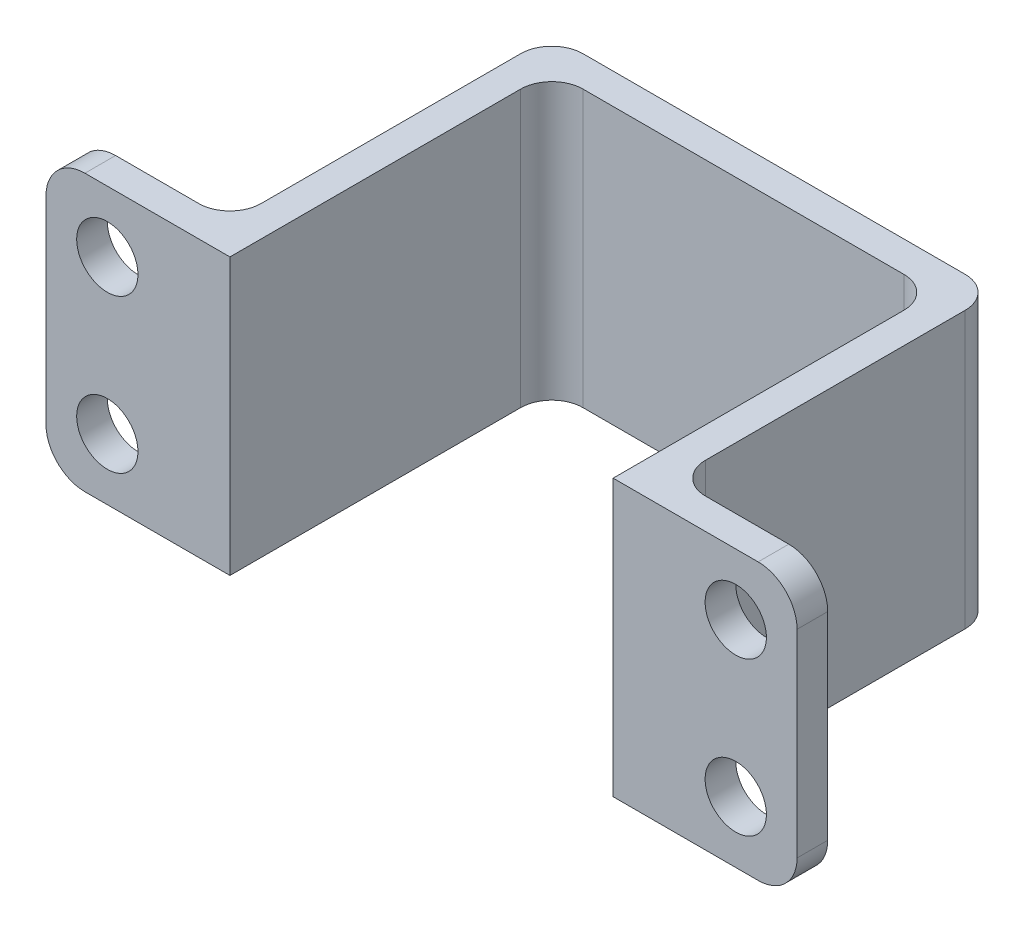
ISO-10303-21;
HEADER;
FILE_DESCRIPTION(('STEP AP214'),'2;1');
FILE_NAME('part.step','',(''),(''),'','','');
FILE_SCHEMA(('AUTOMOTIVE_DESIGN { 1 0 10303 214 1 1 1 1 }'));
ENDSEC;
DATA;
#1=APPLICATION_CONTEXT('core data for automotive mechanical design processes');
#2=APPLICATION_PROTOCOL_DEFINITION('international standard','automotive_design',2000,#1);
#3=PRODUCT_CONTEXT('',#1,'mechanical');
#4=PRODUCT('Part','Part','',(#3));
#5=PRODUCT_RELATED_PRODUCT_CATEGORY('part','',(#4));
#6=PRODUCT_DEFINITION_FORMATION('','',#4);
#7=PRODUCT_DEFINITION_CONTEXT('part definition',#1,'design');
#8=PRODUCT_DEFINITION('design','',#6,#7);
#9=PRODUCT_DEFINITION_SHAPE('','',#8);
#10=(LENGTH_UNIT() NAMED_UNIT(*) SI_UNIT(.MILLI.,.METRE.));
#11=(NAMED_UNIT(*) PLANE_ANGLE_UNIT() SI_UNIT($,.RADIAN.));
#12=(NAMED_UNIT(*) SI_UNIT($,.STERADIAN.) SOLID_ANGLE_UNIT());
#13=UNCERTAINTY_MEASURE_WITH_UNIT(LENGTH_MEASURE(1.E-05),#10,'distance_accuracy_value','');
#14=(GEOMETRIC_REPRESENTATION_CONTEXT(3) GLOBAL_UNCERTAINTY_ASSIGNED_CONTEXT((#13)) GLOBAL_UNIT_ASSIGNED_CONTEXT((#10,
#11,#12)) REPRESENTATION_CONTEXT('',''));
#15=CARTESIAN_POINT('',(0.,0.,0.));
#16=DIRECTION('',(0.,0.,1.));
#17=DIRECTION('',(1.,0.,0.));
#18=AXIS2_PLACEMENT_3D('',#15,#16,#17);
#19=CARTESIAN_POINT('',(0.,9.,0.));
#20=DIRECTION('',(-1.,0.,0.));
#21=DIRECTION('',(0.,0.,1.));
#22=AXIS2_PLACEMENT_3D('',#19,#20,#21);
#23=PLANE('',#22);
#24=DIRECTION('',(0.,0.,-1.));
#25=VECTOR('',#24,1.);
#26=CARTESIAN_POINT('',(0.,0.,0.));
#27=LINE('',#26,#25);
#28=CARTESIAN_POINT('',(0.,0.,0.));
#29=VERTEX_POINT('',#28);
#30=CARTESIAN_POINT('',(0.,0.,-9.48399999999999));
#31=VERTEX_POINT('',#30);
#32=EDGE_CURVE('E333',#29,#31,#27,.T.);
#33=ORIENTED_EDGE('',*,*,#32,.T.);
#34=DIRECTION('',(0.,-1.,0.));
#35=VECTOR('',#34,1.);
#36=CARTESIAN_POINT('',(0.,9.,-9.48399999999999));
#37=LINE('',#36,#35);
#38=CARTESIAN_POINT('',(0.,9.,-9.48399999999999));
#39=VERTEX_POINT('',#38);
#40=EDGE_CURVE('E206',#39,#31,#37,.T.);
#41=ORIENTED_EDGE('',*,*,#40,.F.);
#42=DIRECTION('',(0.,0.,-1.));
#43=VECTOR('',#42,1.);
#44=CARTESIAN_POINT('',(0.,9.,0.));
#45=LINE('',#44,#43);
#46=CARTESIAN_POINT('',(0.,9.,0.));
#47=VERTEX_POINT('',#46);
#48=EDGE_CURVE('E193',#47,#39,#45,.T.);
#49=ORIENTED_EDGE('',*,*,#48,.F.);
#50=DIRECTION('',(0.,-1.,0.));
#51=VECTOR('',#50,1.);
#52=CARTESIAN_POINT('',(0.,9.,0.));
#53=LINE('',#52,#51);
#54=EDGE_CURVE('E204',#47,#29,#53,.T.);
#55=ORIENTED_EDGE('',*,*,#54,.T.);
#56=EDGE_LOOP('',(#33,#41,#49,#55));
#57=FACE_BOUND('',#56,.T.);
#58=ADVANCED_FACE('F39',(#57),#23,.F.);
#59=CARTESIAN_POINT('',(1.016,9.,-9.484));
#60=DIRECTION('',(0.,-1.,0.));
#61=DIRECTION('',(0.,0.,-1.));
#62=AXIS2_PLACEMENT_3D('',#59,#60,#61);
#63=CYLINDRICAL_SURFACE('',#62,1.016);
#64=CARTESIAN_POINT('',(1.016,0.,-9.484));
#65=DIRECTION('',(0.,-1.,0.));
#66=DIRECTION('',(0.,0.,-1.));
#67=AXIS2_PLACEMENT_3D('',#64,#65,#66);
#68=CIRCLE('',#67,1.016);
#69=CARTESIAN_POINT('',(1.016,0.,-10.5));
#70=VERTEX_POINT('',#69);
#71=EDGE_CURVE('E324',#31,#70,#68,.T.);
#72=ORIENTED_EDGE('',*,*,#71,.T.);
#73=DIRECTION('',(0.,-1.,0.));
#74=VECTOR('',#73,1.);
#75=CARTESIAN_POINT('',(1.016,9.,-10.5));
#76=LINE('',#75,#74);
#77=CARTESIAN_POINT('',(1.016,9.,-10.5));
#78=VERTEX_POINT('',#77);
#79=EDGE_CURVE('E222',#78,#70,#76,.T.);
#80=ORIENTED_EDGE('',*,*,#79,.F.);
#81=CARTESIAN_POINT('',(1.016,9.,-9.484));
#82=DIRECTION('',(0.,-1.,0.));
#83=DIRECTION('',(0.,0.,-1.));
#84=AXIS2_PLACEMENT_3D('',#81,#82,#83);
#85=CIRCLE('',#84,1.016);
#86=EDGE_CURVE('E209',#39,#78,#85,.T.);
#87=ORIENTED_EDGE('',*,*,#86,.F.);
#88=ORIENTED_EDGE('',*,*,#40,.T.);
#89=EDGE_LOOP('',(#72,#80,#87,#88));
#90=FACE_BOUND('',#89,.T.);
#91=ADVANCED_FACE('F491',(#90),#63,.F.);
#92=CARTESIAN_POINT('',(1.016,9.,-10.5));
#93=DIRECTION('',(0.,0.,-1.));
#94=DIRECTION('',(-1.,0.,0.));
#95=AXIS2_PLACEMENT_3D('',#92,#93,#94);
#96=PLANE('',#95);
#97=DIRECTION('',(1.,0.,0.));
#98=VECTOR('',#97,1.);
#99=CARTESIAN_POINT('',(1.016,0.,-10.5));
#100=LINE('',#99,#98);
#101=CARTESIAN_POINT('',(11.484,0.,-10.5));
#102=VERTEX_POINT('',#101);
#103=EDGE_CURVE('E317',#70,#102,#100,.T.);
#104=ORIENTED_EDGE('',*,*,#103,.T.);
#105=DIRECTION('',(0.,-1.,0.));
#106=VECTOR('',#105,1.);
#107=CARTESIAN_POINT('',(11.484,9.,-10.5));
#108=LINE('',#107,#106);
#109=CARTESIAN_POINT('',(11.484,9.,-10.5));
#110=VERTEX_POINT('',#109);
#111=EDGE_CURVE('E306',#110,#102,#108,.T.);
#112=ORIENTED_EDGE('',*,*,#111,.F.);
#113=DIRECTION('',(1.,0.,0.));
#114=VECTOR('',#113,1.);
#115=CARTESIAN_POINT('',(1.016,9.,-10.5));
#116=LINE('',#115,#114);
#117=EDGE_CURVE('E318',#78,#110,#116,.T.);
#118=ORIENTED_EDGE('',*,*,#117,.F.);
#119=ORIENTED_EDGE('',*,*,#79,.T.);
#120=EDGE_LOOP('',(#104,#112,#118,#119));
#121=FACE_BOUND('',#120,.T.);
#122=ADVANCED_FACE('F315',(#121),#96,.F.);
#123=CARTESIAN_POINT('',(11.484,9.,-9.484));
#124=DIRECTION('',(0.,-1.,0.));
#125=DIRECTION('',(0.,0.,-1.));
#126=AXIS2_PLACEMENT_3D('',#123,#124,#125);
#127=CYLINDRICAL_SURFACE('',#126,1.016);
#128=CARTESIAN_POINT('',(11.484,0.,-9.484));
#129=DIRECTION('',(0.,-1.,0.));
#130=DIRECTION('',(0.,0.,-1.));
#131=AXIS2_PLACEMENT_3D('',#128,#129,#130);
#132=CIRCLE('',#131,1.016);
#133=CARTESIAN_POINT('',(12.5,0.,-9.48399999999999));
#134=VERTEX_POINT('',#133);
#135=EDGE_CURVE('E326',#102,#134,#132,.T.);
#136=ORIENTED_EDGE('',*,*,#135,.T.);
#137=DIRECTION('',(0.,-1.,0.));
#138=VECTOR('',#137,1.);
#139=CARTESIAN_POINT('',(12.5,9.,-9.48399999999999));
#140=LINE('',#139,#138);
#141=CARTESIAN_POINT('',(12.5,9.,-9.48399999999999));
#142=VERTEX_POINT('',#141);
#143=EDGE_CURVE('E302',#142,#134,#140,.T.);
#144=ORIENTED_EDGE('',*,*,#143,.F.);
#145=CARTESIAN_POINT('',(11.484,9.,-9.484));
#146=DIRECTION('',(0.,-1.,0.));
#147=DIRECTION('',(0.,0.,-1.));
#148=AXIS2_PLACEMENT_3D('',#145,#146,#147);
#149=CIRCLE('',#148,1.016);
#150=EDGE_CURVE('E467',#110,#142,#149,.T.);
#151=ORIENTED_EDGE('',*,*,#150,.F.);
#152=ORIENTED_EDGE('',*,*,#111,.T.);
#153=EDGE_LOOP('',(#136,#144,#151,#152));
#154=FACE_BOUND('',#153,.T.);
#155=ADVANCED_FACE('F561',(#154),#127,.F.);
#156=CARTESIAN_POINT('',(12.5,9.,0.));
#157=DIRECTION('',(1.,0.,0.));
#158=DIRECTION('',(0.,0.,-1.));
#159=AXIS2_PLACEMENT_3D('',#156,#157,#158);
#160=PLANE('',#159);
#161=DIRECTION('',(0.,0.,1.));
#162=VECTOR('',#161,1.);
#163=CARTESIAN_POINT('',(12.5,0.,0.));
#164=LINE('',#163,#162);
#165=CARTESIAN_POINT('',(12.5,0.,0.));
#166=VERTEX_POINT('',#165);
#167=EDGE_CURVE('E331',#134,#166,#164,.T.);
#168=ORIENTED_EDGE('',*,*,#167,.T.);
#169=DIRECTION('',(0.,-1.,0.));
#170=VECTOR('',#169,1.);
#171=CARTESIAN_POINT('',(12.5,9.,0.));
#172=LINE('',#171,#170);
#173=CARTESIAN_POINT('',(12.5,9.,0.));
#174=VERTEX_POINT('',#173);
#175=EDGE_CURVE('E293',#174,#166,#172,.T.);
#176=ORIENTED_EDGE('',*,*,#175,.F.);
#177=DIRECTION('',(0.,0.,1.));
#178=VECTOR('',#177,1.);
#179=CARTESIAN_POINT('',(12.5,9.,0.));
#180=LINE('',#179,#178);
#181=EDGE_CURVE('E276',#142,#174,#180,.T.);
#182=ORIENTED_EDGE('',*,*,#181,.F.);
#183=ORIENTED_EDGE('',*,*,#143,.T.);
#184=EDGE_LOOP('',(#168,#176,#182,#183));
#185=FACE_BOUND('',#184,.T.);
#186=ADVANCED_FACE('F557',(#185),#160,.F.);
#187=CARTESIAN_POINT('',(13.5,9.,0.));
#188=DIRECTION('',(0.,0.,-1.));
#189=DIRECTION('',(-1.,0.,0.));
#190=AXIS2_PLACEMENT_3D('',#187,#188,#189);
#191=PLANE('',#190);
#192=CARTESIAN_POINT('',(16.5,2.,0.));
#193=DIRECTION('',(0.,0.,-1.));
#194=DIRECTION('',(-1.,0.,0.));
#195=AXIS2_PLACEMENT_3D('',#192,#193,#194);
#196=CIRCLE('',#195,1.);
#197=CARTESIAN_POINT('',(15.5,2.,0.));
#198=VERTEX_POINT('',#197);
#199=EDGE_CURVE('E733',#198,#198,#196,.T.);
#200=ORIENTED_EDGE('',*,*,#199,.T.);
#201=EDGE_LOOP('',(#200));
#202=FACE_BOUND('',#201,.T.);
#203=CARTESIAN_POINT('',(16.5,7.,0.));
#204=DIRECTION('',(0.,0.,-1.));
#205=DIRECTION('',(-1.,0.,0.));
#206=AXIS2_PLACEMENT_3D('',#203,#204,#205);
#207=CIRCLE('',#206,1.);
#208=CARTESIAN_POINT('',(15.5,7.,0.));
#209=VERTEX_POINT('',#208);
#210=EDGE_CURVE('E745',#209,#209,#207,.T.);
#211=ORIENTED_EDGE('',*,*,#210,.T.);
#212=EDGE_LOOP('',(#211));
#213=FACE_BOUND('',#212,.T.);
#214=DIRECTION('',(1.,0.,0.));
#215=VECTOR('',#214,1.);
#216=CARTESIAN_POINT('',(13.5,0.,0.));
#217=LINE('',#216,#215);
#218=CARTESIAN_POINT('',(17.23,0.,0.));
#219=VERTEX_POINT('',#218);
#220=EDGE_CURVE('E340',#166,#219,#217,.T.);
#221=ORIENTED_EDGE('',*,*,#220,.T.);
#222=CARTESIAN_POINT('',(17.23,1.27,0.));
#223=DIRECTION('',(0.,0.,-1.));
#224=DIRECTION('',(-1.,0.,0.));
#225=AXIS2_PLACEMENT_3D('',#222,#223,#224);
#226=CIRCLE('',#225,1.27);
#227=CARTESIAN_POINT('',(18.5,1.27,0.));
#228=VERTEX_POINT('',#227);
#229=EDGE_CURVE('E11',#219,#228,#226,.F.);
#230=ORIENTED_EDGE('',*,*,#229,.T.);
#231=DIRECTION('',(0.,-1.,0.));
#232=VECTOR('',#231,1.);
#233=CARTESIAN_POINT('',(18.5,9.,0.));
#234=LINE('',#233,#232);
#235=CARTESIAN_POINT('',(18.5,7.73,0.));
#236=VERTEX_POINT('',#235);
#237=EDGE_CURVE('E271',#236,#228,#234,.T.);
#238=ORIENTED_EDGE('',*,*,#237,.F.);
#239=CARTESIAN_POINT('',(17.23,7.73,0.));
#240=DIRECTION('',(0.,0.,-1.));
#241=DIRECTION('',(-1.,0.,0.));
#242=AXIS2_PLACEMENT_3D('',#239,#240,#241);
#243=CIRCLE('',#242,1.27);
#244=CARTESIAN_POINT('',(17.23,9.,0.));
#245=VERTEX_POINT('',#244);
#246=EDGE_CURVE('E48',#236,#245,#243,.F.);
#247=ORIENTED_EDGE('',*,*,#246,.T.);
#248=DIRECTION('',(1.,0.,0.));
#249=VECTOR('',#248,1.);
#250=CARTESIAN_POINT('',(12.5,9.,0.));
#251=LINE('',#250,#249);
#252=EDGE_CURVE('E270',#174,#245,#251,.T.);
#253=ORIENTED_EDGE('',*,*,#252,.F.);
#254=ORIENTED_EDGE('',*,*,#175,.T.);
#255=EDGE_LOOP('',(#221,#230,#238,#247,#253,#254));
#256=FACE_BOUND('',#255,.T.);
#257=ADVANCED_FACE('F268',(#202,#213,#256),#191,.F.);
#258=CARTESIAN_POINT('',(18.5,9.,0.));
#259=DIRECTION('',(-1.,0.,0.));
#260=DIRECTION('',(0.,0.,1.));
#261=AXIS2_PLACEMENT_3D('',#258,#259,#260);
#262=PLANE('',#261);
#263=ORIENTED_EDGE('',*,*,#237,.T.);
#264=DIRECTION('',(0.,0.,-1.));
#265=VECTOR('',#264,1.);
#266=CARTESIAN_POINT('',(18.5,1.27,-1.));
#267=LINE('',#266,#265);
#268=CARTESIAN_POINT('',(18.5,1.27,-1.));
#269=VERTEX_POINT('',#268);
#270=EDGE_CURVE('E255',#228,#269,#267,.T.);
#271=ORIENTED_EDGE('',*,*,#270,.T.);
#272=DIRECTION('',(0.,-1.,0.));
#273=VECTOR('',#272,1.);
#274=CARTESIAN_POINT('',(18.5,9.,-1.));
#275=LINE('',#274,#273);
#276=CARTESIAN_POINT('',(18.5,7.73,-1.));
#277=VERTEX_POINT('',#276);
#278=EDGE_CURVE('E284',#277,#269,#275,.T.);
#279=ORIENTED_EDGE('',*,*,#278,.F.);
#280=DIRECTION('',(0.,0.,-1.));
#281=VECTOR('',#280,1.);
#282=CARTESIAN_POINT('',(18.5,7.73,0.));
#283=LINE('',#282,#281);
#284=EDGE_CURVE('E60',#277,#236,#283,.F.);
#285=ORIENTED_EDGE('',*,*,#284,.T.);
#286=EDGE_LOOP('',(#263,#271,#279,#285));
#287=FACE_BOUND('',#286,.T.);
#288=ADVANCED_FACE('F286',(#287),#262,.F.);
#289=CARTESIAN_POINT('',(14.516,9.,-1.));
#290=DIRECTION('',(0.,0.,1.));
#291=DIRECTION('',(1.,0.,0.));
#292=AXIS2_PLACEMENT_3D('',#289,#290,#291);
#293=PLANE('',#292);
#294=CARTESIAN_POINT('',(16.5,2.,-1.));
#295=DIRECTION('',(0.,0.,-1.));
#296=DIRECTION('',(-1.,0.,0.));
#297=AXIS2_PLACEMENT_3D('',#294,#295,#296);
#298=CIRCLE('',#297,1.);
#299=CARTESIAN_POINT('',(15.5,2.,-1.));
#300=VERTEX_POINT('',#299);
#301=EDGE_CURVE('E460',#300,#300,#298,.T.);
#302=ORIENTED_EDGE('',*,*,#301,.F.);
#303=EDGE_LOOP('',(#302));
#304=FACE_BOUND('',#303,.T.);
#305=CARTESIAN_POINT('',(16.5,7.,-1.));
#306=DIRECTION('',(0.,0.,-1.));
#307=DIRECTION('',(-1.,0.,0.));
#308=AXIS2_PLACEMENT_3D('',#305,#306,#307);
#309=CIRCLE('',#308,1.);
#310=CARTESIAN_POINT('',(15.5,7.,-1.));
#311=VERTEX_POINT('',#310);
#312=EDGE_CURVE('E741',#311,#311,#309,.T.);
#313=ORIENTED_EDGE('',*,*,#312,.F.);
#314=EDGE_LOOP('',(#313));
#315=FACE_BOUND('',#314,.T.);
#316=ORIENTED_EDGE('',*,*,#278,.T.);
#317=CARTESIAN_POINT('',(17.23,1.27,-1.));
#318=DIRECTION('',(0.,0.,1.));
#319=DIRECTION('',(1.,0.,0.));
#320=AXIS2_PLACEMENT_3D('',#317,#318,#319);
#321=CIRCLE('',#320,1.27);
#322=CARTESIAN_POINT('',(17.23,0.,-1.));
#323=VERTEX_POINT('',#322);
#324=EDGE_CURVE('E262',#269,#323,#321,.F.);
#325=ORIENTED_EDGE('',*,*,#324,.T.);
#326=DIRECTION('',(-1.,0.,0.));
#327=VECTOR('',#326,1.);
#328=CARTESIAN_POINT('',(14.516,0.,-1.));
#329=LINE('',#328,#327);
#330=CARTESIAN_POINT('',(14.516,0.,-1.));
#331=VERTEX_POINT('',#330);
#332=EDGE_CURVE('E343',#323,#331,#329,.T.);
#333=ORIENTED_EDGE('',*,*,#332,.T.);
#334=DIRECTION('',(0.,-1.,0.));
#335=VECTOR('',#334,1.);
#336=CARTESIAN_POINT('',(14.516,9.,-1.));
#337=LINE('',#336,#335);
#338=CARTESIAN_POINT('',(14.516,9.,-1.));
#339=VERTEX_POINT('',#338);
#340=EDGE_CURVE('E289',#339,#331,#337,.T.);
#341=ORIENTED_EDGE('',*,*,#340,.F.);
#342=DIRECTION('',(-1.,0.,0.));
#343=VECTOR('',#342,1.);
#344=CARTESIAN_POINT('',(14.516,9.,-1.));
#345=LINE('',#344,#343);
#346=CARTESIAN_POINT('',(17.23,9.,-1.));
#347=VERTEX_POINT('',#346);
#348=EDGE_CURVE('E279',#347,#339,#345,.T.);
#349=ORIENTED_EDGE('',*,*,#348,.F.);
#350=CARTESIAN_POINT('',(17.23,7.73,-0.999999999999999));
#351=DIRECTION('',(0.,0.,1.));
#352=DIRECTION('',(1.,0.,0.));
#353=AXIS2_PLACEMENT_3D('',#350,#351,#352);
#354=CIRCLE('',#353,1.27);
#355=EDGE_CURVE('E259',#347,#277,#354,.F.);
#356=ORIENTED_EDGE('',*,*,#355,.T.);
#357=EDGE_LOOP('',(#316,#325,#333,#341,#349,#356));
#358=FACE_BOUND('',#357,.T.);
#359=ADVANCED_FACE('F283',(#304,#315,#358),#293,.F.);
#360=CARTESIAN_POINT('',(14.516,9.,-2.016));
#361=DIRECTION('',(0.,-1.,0.));
#362=DIRECTION('',(0.,0.,-1.));
#363=AXIS2_PLACEMENT_3D('',#360,#361,#362);
#364=CYLINDRICAL_SURFACE('',#363,1.016);
#365=CARTESIAN_POINT('',(14.516,0.,-2.016));
#366=DIRECTION('',(0.,-1.,0.));
#367=DIRECTION('',(0.,0.,1.));
#368=AXIS2_PLACEMENT_3D('',#365,#366,#367);
#369=CIRCLE('',#368,1.016);
#370=CARTESIAN_POINT('',(13.5,0.,-2.01600000000001));
#371=VERTEX_POINT('',#370);
#372=EDGE_CURVE('E346',#331,#371,#369,.T.);
#373=ORIENTED_EDGE('',*,*,#372,.T.);
#374=DIRECTION('',(0.,-1.,0.));
#375=VECTOR('',#374,1.);
#376=CARTESIAN_POINT('',(13.5,9.,-2.01600000000001));
#377=LINE('',#376,#375);
#378=CARTESIAN_POINT('',(13.5,9.,-2.01600000000001));
#379=VERTEX_POINT('',#378);
#380=EDGE_CURVE('E296',#379,#371,#377,.T.);
#381=ORIENTED_EDGE('',*,*,#380,.F.);
#382=CARTESIAN_POINT('',(14.516,9.,-2.016));
#383=DIRECTION('',(0.,-1.,0.));
#384=DIRECTION('',(0.,0.,1.));
#385=AXIS2_PLACEMENT_3D('',#382,#383,#384);
#386=CIRCLE('',#385,1.016);
#387=EDGE_CURVE('E474',#339,#379,#386,.T.);
#388=ORIENTED_EDGE('',*,*,#387,.F.);
#389=ORIENTED_EDGE('',*,*,#340,.T.);
#390=EDGE_LOOP('',(#373,#381,#388,#389));
#391=FACE_BOUND('',#390,.T.);
#392=ADVANCED_FACE('F477',(#391),#364,.F.);
#393=CARTESIAN_POINT('',(13.5,9.,-2.01600000000001));
#394=DIRECTION('',(-1.,0.,0.));
#395=DIRECTION('',(0.,0.,1.));
#396=AXIS2_PLACEMENT_3D('',#393,#394,#395);
#397=PLANE('',#396);
#398=DIRECTION('',(0.,0.,-1.));
#399=VECTOR('',#398,1.);
#400=CARTESIAN_POINT('',(13.5,0.,-2.01600000000001));
#401=LINE('',#400,#399);
#402=CARTESIAN_POINT('',(13.5,0.,-10.484));
#403=VERTEX_POINT('',#402);
#404=EDGE_CURVE('E349',#371,#403,#401,.T.);
#405=ORIENTED_EDGE('',*,*,#404,.T.);
#406=DIRECTION('',(0.,-1.,0.));
#407=VECTOR('',#406,1.);
#408=CARTESIAN_POINT('',(13.5,9.,-10.484));
#409=LINE('',#408,#407);
#410=CARTESIAN_POINT('',(13.5,9.,-10.484));
#411=VERTEX_POINT('',#410);
#412=EDGE_CURVE('E401',#411,#403,#409,.T.);
#413=ORIENTED_EDGE('',*,*,#412,.F.);
#414=DIRECTION('',(0.,0.,-1.));
#415=VECTOR('',#414,1.);
#416=CARTESIAN_POINT('',(13.5,9.,-2.01600000000001));
#417=LINE('',#416,#415);
#418=EDGE_CURVE('E412',#379,#411,#417,.T.);
#419=ORIENTED_EDGE('',*,*,#418,.F.);
#420=ORIENTED_EDGE('',*,*,#380,.T.);
#421=EDGE_LOOP('',(#405,#413,#419,#420));
#422=FACE_BOUND('',#421,.T.);
#423=ADVANCED_FACE('F410',(#422),#397,.F.);
#424=CARTESIAN_POINT('',(12.484,9.,-10.484));
#425=DIRECTION('',(0.,-1.,0.));
#426=DIRECTION('',(0.,0.,-1.));
#427=AXIS2_PLACEMENT_3D('',#424,#425,#426);
#428=CYLINDRICAL_SURFACE('',#427,1.016);
#429=CARTESIAN_POINT('',(12.484,0.,-10.484));
#430=DIRECTION('',(0.,1.,0.));
#431=DIRECTION('',(0.,0.,-1.));
#432=AXIS2_PLACEMENT_3D('',#429,#430,#431);
#433=CIRCLE('',#432,1.016);
#434=CARTESIAN_POINT('',(12.484,0.,-11.5));
#435=VERTEX_POINT('',#434);
#436=EDGE_CURVE('E352',#403,#435,#433,.T.);
#437=ORIENTED_EDGE('',*,*,#436,.T.);
#438=DIRECTION('',(0.,-1.,0.));
#439=VECTOR('',#438,1.);
#440=CARTESIAN_POINT('',(12.484,9.,-11.5));
#441=LINE('',#440,#439);
#442=CARTESIAN_POINT('',(12.484,9.,-11.5));
#443=VERTEX_POINT('',#442);
#444=EDGE_CURVE('E397',#443,#435,#441,.T.);
#445=ORIENTED_EDGE('',*,*,#444,.F.);
#446=CARTESIAN_POINT('',(12.484,9.,-10.484));
#447=DIRECTION('',(0.,1.,0.));
#448=DIRECTION('',(0.,0.,-1.));
#449=AXIS2_PLACEMENT_3D('',#446,#447,#448);
#450=CIRCLE('',#449,1.016);
#451=EDGE_CURVE('E432',#411,#443,#450,.T.);
#452=ORIENTED_EDGE('',*,*,#451,.F.);
#453=ORIENTED_EDGE('',*,*,#412,.T.);
#454=EDGE_LOOP('',(#437,#445,#452,#453));
#455=FACE_BOUND('',#454,.T.);
#456=ADVANCED_FACE('F422',(#455),#428,.T.);
#457=CARTESIAN_POINT('',(0.0160000000000071,9.,-11.5));
#458=DIRECTION('',(0.,0.,1.));
#459=DIRECTION('',(1.,0.,0.));
#460=AXIS2_PLACEMENT_3D('',#457,#458,#459);
#461=PLANE('',#460);
#462=DIRECTION('',(-1.,0.,0.));
#463=VECTOR('',#462,1.);
#464=CARTESIAN_POINT('',(0.0160000000000071,0.,-11.5));
#465=LINE('',#464,#463);
#466=CARTESIAN_POINT('',(0.0160000000000071,0.,-11.5));
#467=VERTEX_POINT('',#466);
#468=EDGE_CURVE('E355',#435,#467,#465,.T.);
#469=ORIENTED_EDGE('',*,*,#468,.T.);
#470=DIRECTION('',(0.,-1.,0.));
#471=VECTOR('',#470,1.);
#472=CARTESIAN_POINT('',(0.0160000000000071,9.,-11.5));
#473=LINE('',#472,#471);
#474=CARTESIAN_POINT('',(0.0160000000000071,9.,-11.5));
#475=VERTEX_POINT('',#474);
#476=EDGE_CURVE('E393',#475,#467,#473,.T.);
#477=ORIENTED_EDGE('',*,*,#476,.F.);
#478=DIRECTION('',(-1.,0.,0.));
#479=VECTOR('',#478,1.);
#480=CARTESIAN_POINT('',(0.0160000000000071,9.,-11.5));
#481=LINE('',#480,#479);
#482=EDGE_CURVE('E428',#443,#475,#481,.T.);
#483=ORIENTED_EDGE('',*,*,#482,.F.);
#484=ORIENTED_EDGE('',*,*,#444,.T.);
#485=EDGE_LOOP('',(#469,#477,#483,#484));
#486=FACE_BOUND('',#485,.T.);
#487=ADVANCED_FACE('F426',(#486),#461,.F.);
#488=CARTESIAN_POINT('',(0.0159999999999997,9.,-10.484));
#489=DIRECTION('',(0.,-1.,0.));
#490=DIRECTION('',(0.,0.,-1.));
#491=AXIS2_PLACEMENT_3D('',#488,#489,#490);
#492=CYLINDRICAL_SURFACE('',#491,1.016);
#493=CARTESIAN_POINT('',(0.0159999999999997,0.,-10.484));
#494=DIRECTION('',(0.,1.,0.));
#495=DIRECTION('',(0.,0.,-1.));
#496=AXIS2_PLACEMENT_3D('',#493,#494,#495);
#497=CIRCLE('',#496,1.016);
#498=CARTESIAN_POINT('',(-1.,0.,-10.484));
#499=VERTEX_POINT('',#498);
#500=EDGE_CURVE('E358',#467,#499,#497,.T.);
#501=ORIENTED_EDGE('',*,*,#500,.T.);
#502=DIRECTION('',(0.,-1.,0.));
#503=VECTOR('',#502,1.);
#504=CARTESIAN_POINT('',(-1.,9.,-10.484));
#505=LINE('',#504,#503);
#506=CARTESIAN_POINT('',(-1.,9.,-10.484));
#507=VERTEX_POINT('',#506);
#508=EDGE_CURVE('E389',#507,#499,#505,.T.);
#509=ORIENTED_EDGE('',*,*,#508,.F.);
#510=CARTESIAN_POINT('',(0.0159999999999997,9.,-10.484));
#511=DIRECTION('',(0.,1.,0.));
#512=DIRECTION('',(0.,0.,-1.));
#513=AXIS2_PLACEMENT_3D('',#510,#511,#512);
#514=CIRCLE('',#513,1.016);
#515=EDGE_CURVE('E431',#475,#507,#514,.T.);
#516=ORIENTED_EDGE('',*,*,#515,.F.);
#517=ORIENTED_EDGE('',*,*,#476,.T.);
#518=EDGE_LOOP('',(#501,#509,#516,#517));
#519=FACE_BOUND('',#518,.T.);
#520=ADVANCED_FACE('F533',(#519),#492,.T.);
#521=CARTESIAN_POINT('',(-1.,9.,-2.01600000000001));
#522=DIRECTION('',(1.,0.,0.));
#523=DIRECTION('',(0.,0.,-1.));
#524=AXIS2_PLACEMENT_3D('',#521,#522,#523);
#525=PLANE('',#524);
#526=DIRECTION('',(0.,0.,1.));
#527=VECTOR('',#526,1.);
#528=CARTESIAN_POINT('',(-1.,0.,-2.01600000000001));
#529=LINE('',#528,#527);
#530=CARTESIAN_POINT('',(-1.,0.,-2.01600000000001));
#531=VERTEX_POINT('',#530);
#532=EDGE_CURVE('E361',#499,#531,#529,.T.);
#533=ORIENTED_EDGE('',*,*,#532,.T.);
#534=DIRECTION('',(0.,-1.,0.));
#535=VECTOR('',#534,1.);
#536=CARTESIAN_POINT('',(-1.,9.,-2.01600000000001));
#537=LINE('',#536,#535);
#538=CARTESIAN_POINT('',(-1.,9.,-2.01600000000001));
#539=VERTEX_POINT('',#538);
#540=EDGE_CURVE('E385',#539,#531,#537,.T.);
#541=ORIENTED_EDGE('',*,*,#540,.F.);
#542=DIRECTION('',(0.,0.,1.));
#543=VECTOR('',#542,1.);
#544=CARTESIAN_POINT('',(-1.,9.,-2.01600000000001));
#545=LINE('',#544,#543);
#546=EDGE_CURVE('E436',#507,#539,#545,.T.);
#547=ORIENTED_EDGE('',*,*,#546,.F.);
#548=ORIENTED_EDGE('',*,*,#508,.T.);
#549=EDGE_LOOP('',(#533,#541,#547,#548));
#550=FACE_BOUND('',#549,.T.);
#551=ADVANCED_FACE('F530',(#550),#525,.F.);
#552=CARTESIAN_POINT('',(-2.016,9.,-2.016));
#553=DIRECTION('',(0.,-1.,0.));
#554=DIRECTION('',(0.,0.,-1.));
#555=AXIS2_PLACEMENT_3D('',#552,#553,#554);
#556=CYLINDRICAL_SURFACE('',#555,1.016);
#557=CARTESIAN_POINT('',(-2.016,0.,-2.016));
#558=DIRECTION('',(0.,-1.,0.));
#559=DIRECTION('',(0.,0.,-1.));
#560=AXIS2_PLACEMENT_3D('',#557,#558,#559);
#561=CIRCLE('',#560,1.016);
#562=CARTESIAN_POINT('',(-2.01600000000001,0.,-1.));
#563=VERTEX_POINT('',#562);
#564=EDGE_CURVE('E364',#531,#563,#561,.T.);
#565=ORIENTED_EDGE('',*,*,#564,.T.);
#566=DIRECTION('',(0.,-1.,0.));
#567=VECTOR('',#566,1.);
#568=CARTESIAN_POINT('',(-2.01600000000001,9.,-1.));
#569=LINE('',#568,#567);
#570=CARTESIAN_POINT('',(-2.01600000000001,9.,-1.));
#571=VERTEX_POINT('',#570);
#572=EDGE_CURVE('E381',#571,#563,#569,.T.);
#573=ORIENTED_EDGE('',*,*,#572,.F.);
#574=CARTESIAN_POINT('',(-2.016,9.,-2.016));
#575=DIRECTION('',(0.,-1.,0.));
#576=DIRECTION('',(0.,0.,-1.));
#577=AXIS2_PLACEMENT_3D('',#574,#575,#576);
#578=CIRCLE('',#577,1.016);
#579=EDGE_CURVE('E443',#539,#571,#578,.T.);
#580=ORIENTED_EDGE('',*,*,#579,.F.);
#581=ORIENTED_EDGE('',*,*,#540,.T.);
#582=EDGE_LOOP('',(#565,#573,#580,#581));
#583=FACE_BOUND('',#582,.T.);
#584=ADVANCED_FACE('F526',(#583),#556,.F.);
#585=CARTESIAN_POINT('',(-2.01600000000001,9.,-1.));
#586=DIRECTION('',(0.,0.,1.));
#587=DIRECTION('',(1.,0.,0.));
#588=AXIS2_PLACEMENT_3D('',#585,#586,#587);
#589=PLANE('',#588);
#590=CARTESIAN_POINT('',(-4.,7.,-1.));
#591=DIRECTION('',(0.,0.,-1.));
#592=DIRECTION('',(-1.,0.,0.));
#593=AXIS2_PLACEMENT_3D('',#590,#591,#592);
#594=CIRCLE('',#593,1.);
#595=CARTESIAN_POINT('',(-5.,7.,-0.999999999999999));
#596=VERTEX_POINT('',#595);
#597=EDGE_CURVE('E728',#596,#596,#594,.T.);
#598=ORIENTED_EDGE('',*,*,#597,.F.);
#599=EDGE_LOOP('',(#598));
#600=FACE_BOUND('',#599,.T.);
#601=CARTESIAN_POINT('',(-4.,2.,-1.));
#602=DIRECTION('',(0.,0.,-1.));
#603=DIRECTION('',(-1.,0.,0.));
#604=AXIS2_PLACEMENT_3D('',#601,#602,#603);
#605=CIRCLE('',#604,1.);
#606=CARTESIAN_POINT('',(-5.,2.,-0.999999999999999));
#607=VERTEX_POINT('',#606);
#608=EDGE_CURVE('E451',#607,#607,#605,.T.);
#609=ORIENTED_EDGE('',*,*,#608,.F.);
#610=EDGE_LOOP('',(#609));
#611=FACE_BOUND('',#610,.T.);
#612=DIRECTION('',(-1.,0.,0.));
#613=VECTOR('',#612,1.);
#614=CARTESIAN_POINT('',(-2.01600000000001,0.,-1.));
#615=LINE('',#614,#613);
#616=CARTESIAN_POINT('',(-4.73,0.,-1.));
#617=VERTEX_POINT('',#616);
#618=EDGE_CURVE('E367',#563,#617,#615,.T.);
#619=ORIENTED_EDGE('',*,*,#618,.T.);
#620=CARTESIAN_POINT('',(-4.73,1.27,-1.));
#621=DIRECTION('',(0.,0.,1.));
#622=DIRECTION('',(1.,0.,0.));
#623=AXIS2_PLACEMENT_3D('',#620,#621,#622);
#624=CIRCLE('',#623,1.27);
#625=CARTESIAN_POINT('',(-6.,1.27,-0.999999999999999));
#626=VERTEX_POINT('',#625);
#627=EDGE_CURVE('E244',#617,#626,#624,.F.);
#628=ORIENTED_EDGE('',*,*,#627,.T.);
#629=DIRECTION('',(0.,-1.,0.));
#630=VECTOR('',#629,1.);
#631=CARTESIAN_POINT('',(-6.,9.,-0.999999999999999));
#632=LINE('',#631,#630);
#633=CARTESIAN_POINT('',(-6.,7.73,-0.999999999999999));
#634=VERTEX_POINT('',#633);
#635=EDGE_CURVE('E376',#634,#626,#632,.T.);
#636=ORIENTED_EDGE('',*,*,#635,.F.);
#637=CARTESIAN_POINT('',(-4.73,7.73,-0.999999999999999));
#638=DIRECTION('',(0.,0.,1.));
#639=DIRECTION('',(1.,0.,0.));
#640=AXIS2_PLACEMENT_3D('',#637,#638,#639);
#641=CIRCLE('',#640,1.27);
#642=CARTESIAN_POINT('',(-4.73,9.,-1.));
#643=VERTEX_POINT('',#642);
#644=EDGE_CURVE('E241',#634,#643,#641,.F.);
#645=ORIENTED_EDGE('',*,*,#644,.T.);
#646=DIRECTION('',(-1.,0.,0.));
#647=VECTOR('',#646,1.);
#648=CARTESIAN_POINT('',(-2.01600000000001,9.,-1.));
#649=LINE('',#648,#647);
#650=EDGE_CURVE('E377',#571,#643,#649,.T.);
#651=ORIENTED_EDGE('',*,*,#650,.F.);
#652=ORIENTED_EDGE('',*,*,#572,.T.);
#653=EDGE_LOOP('',(#619,#628,#636,#645,#651,#652));
#654=FACE_BOUND('',#653,.T.);
#655=ADVANCED_FACE('F513',(#600,#611,#654),#589,.F.);
#656=CARTESIAN_POINT('',(-6.,9.,0.));
#657=DIRECTION('',(1.,0.,0.));
#658=DIRECTION('',(0.,0.,-1.));
#659=AXIS2_PLACEMENT_3D('',#656,#657,#658);
#660=PLANE('',#659);
#661=ORIENTED_EDGE('',*,*,#635,.T.);
#662=DIRECTION('',(0.,0.,1.));
#663=VECTOR('',#662,1.);
#664=CARTESIAN_POINT('',(-6.,1.27,0.));
#665=LINE('',#664,#663);
#666=CARTESIAN_POINT('',(-6.,1.27,0.));
#667=VERTEX_POINT('',#666);
#668=EDGE_CURVE('E220',#626,#667,#665,.T.);
#669=ORIENTED_EDGE('',*,*,#668,.T.);
#670=DIRECTION('',(0.,-1.,0.));
#671=VECTOR('',#670,1.);
#672=CARTESIAN_POINT('',(-6.,9.,0.));
#673=LINE('',#672,#671);
#674=CARTESIAN_POINT('',(-6.,7.73,0.));
#675=VERTEX_POINT('',#674);
#676=EDGE_CURVE('E373',#675,#667,#673,.T.);
#677=ORIENTED_EDGE('',*,*,#676,.F.);
#678=DIRECTION('',(0.,0.,1.));
#679=VECTOR('',#678,1.);
#680=CARTESIAN_POINT('',(-6.,7.73,0.));
#681=LINE('',#680,#679);
#682=EDGE_CURVE('E216',#675,#634,#681,.F.);
#683=ORIENTED_EDGE('',*,*,#682,.T.);
#684=EDGE_LOOP('',(#661,#669,#677,#683));
#685=FACE_BOUND('',#684,.T.);
#686=ADVANCED_FACE('F517',(#685),#660,.F.);
#687=CARTESIAN_POINT('',(-0.999998,9.,0.));
#688=DIRECTION('',(0.,0.,-1.));
#689=DIRECTION('',(-1.,0.,0.));
#690=AXIS2_PLACEMENT_3D('',#687,#688,#689);
#691=PLANE('',#690);
#692=CARTESIAN_POINT('',(-4.,7.,0.));
#693=DIRECTION('',(0.,0.,-1.));
#694=DIRECTION('',(-1.,0.,0.));
#695=AXIS2_PLACEMENT_3D('',#692,#693,#694);
#696=CIRCLE('',#695,1.);
#697=CARTESIAN_POINT('',(-5.,7.,0.));
#698=VERTEX_POINT('',#697);
#699=EDGE_CURVE('E457',#698,#698,#696,.T.);
#700=ORIENTED_EDGE('',*,*,#699,.T.);
#701=EDGE_LOOP('',(#700));
#702=FACE_BOUND('',#701,.T.);
#703=CARTESIAN_POINT('',(-4.,2.,0.));
#704=DIRECTION('',(0.,0.,-1.));
#705=DIRECTION('',(-1.,0.,0.));
#706=AXIS2_PLACEMENT_3D('',#703,#704,#705);
#707=CIRCLE('',#706,1.);
#708=CARTESIAN_POINT('',(-5.,2.,0.));
#709=VERTEX_POINT('',#708);
#710=EDGE_CURVE('E448',#709,#709,#707,.T.);
#711=ORIENTED_EDGE('',*,*,#710,.T.);
#712=EDGE_LOOP('',(#711));
#713=FACE_BOUND('',#712,.T.);
#714=ORIENTED_EDGE('',*,*,#676,.T.);
#715=CARTESIAN_POINT('',(-4.73,1.27,0.));
#716=DIRECTION('',(0.,0.,-1.));
#717=DIRECTION('',(-1.,0.,0.));
#718=AXIS2_PLACEMENT_3D('',#715,#716,#717);
#719=CIRCLE('',#718,1.27);
#720=CARTESIAN_POINT('',(-4.73,0.,0.));
#721=VERTEX_POINT('',#720);
#722=EDGE_CURVE('E232',#667,#721,#719,.F.);
#723=ORIENTED_EDGE('',*,*,#722,.T.);
#724=DIRECTION('',(1.,0.,0.));
#725=VECTOR('',#724,1.);
#726=CARTESIAN_POINT('',(-0.999998,0.,0.));
#727=LINE('',#726,#725);
#728=EDGE_CURVE('E200',#721,#29,#727,.T.);
#729=ORIENTED_EDGE('',*,*,#728,.T.);
#730=ORIENTED_EDGE('',*,*,#54,.F.);
#731=DIRECTION('',(1.,0.,0.));
#732=VECTOR('',#731,1.);
#733=CARTESIAN_POINT('',(-0.999998,9.,0.));
#734=LINE('',#733,#732);
#735=CARTESIAN_POINT('',(-4.73,9.,0.));
#736=VERTEX_POINT('',#735);
#737=EDGE_CURVE('E189',#736,#47,#734,.T.);
#738=ORIENTED_EDGE('',*,*,#737,.F.);
#739=CARTESIAN_POINT('',(-4.73,7.73,0.));
#740=DIRECTION('',(0.,0.,-1.));
#741=DIRECTION('',(-1.,0.,0.));
#742=AXIS2_PLACEMENT_3D('',#739,#740,#741);
#743=CIRCLE('',#742,1.27);
#744=EDGE_CURVE('E229',#736,#675,#743,.F.);
#745=ORIENTED_EDGE('',*,*,#744,.T.);
#746=EDGE_LOOP('',(#714,#723,#729,#730,#738,#745));
#747=FACE_BOUND('',#746,.T.);
#748=ADVANCED_FACE('F212',(#702,#713,#747),#691,.F.);
#749=CARTESIAN_POINT('',(1.016,9.,-9.484));
#750=DIRECTION('',(0.,-1.,0.));
#751=DIRECTION('',(0.,0.,-1.));
#752=AXIS2_PLACEMENT_3D('',#749,#750,#751);
#753=PLANE('',#752);
#754=ORIENTED_EDGE('',*,*,#650,.T.);
#755=DIRECTION('',(0.,0.,1.));
#756=VECTOR('',#755,1.);
#757=CARTESIAN_POINT('',(-4.73,9.,-9.484));
#758=LINE('',#757,#756);
#759=EDGE_CURVE('E196',#643,#736,#758,.T.);
#760=ORIENTED_EDGE('',*,*,#759,.T.);
#761=ORIENTED_EDGE('',*,*,#737,.T.);
#762=ORIENTED_EDGE('',*,*,#48,.T.);
#763=ORIENTED_EDGE('',*,*,#86,.T.);
#764=ORIENTED_EDGE('',*,*,#117,.T.);
#765=ORIENTED_EDGE('',*,*,#150,.T.);
#766=ORIENTED_EDGE('',*,*,#181,.T.);
#767=ORIENTED_EDGE('',*,*,#252,.T.);
#768=DIRECTION('',(0.,0.,-1.));
#769=VECTOR('',#768,1.);
#770=CARTESIAN_POINT('',(17.23,9.,-9.484));
#771=LINE('',#770,#769);
#772=EDGE_CURVE('E247',#245,#347,#771,.T.);
#773=ORIENTED_EDGE('',*,*,#772,.T.);
#774=ORIENTED_EDGE('',*,*,#348,.T.);
#775=ORIENTED_EDGE('',*,*,#387,.T.);
#776=ORIENTED_EDGE('',*,*,#418,.T.);
#777=ORIENTED_EDGE('',*,*,#451,.T.);
#778=ORIENTED_EDGE('',*,*,#482,.T.);
#779=ORIENTED_EDGE('',*,*,#515,.T.);
#780=ORIENTED_EDGE('',*,*,#546,.T.);
#781=ORIENTED_EDGE('',*,*,#579,.T.);
#782=EDGE_LOOP('',(#754,#760,#761,#762,#763,#764,#765,#766,#767,#773,#774,#775,#776,#777,#778,
#779,#780,#781));
#783=FACE_BOUND('',#782,.T.);
#784=ADVANCED_FACE('F192',(#783),#753,.F.);
#785=CARTESIAN_POINT('',(1.016,0.,-9.484));
#786=DIRECTION('',(0.,-1.,0.));
#787=DIRECTION('',(0.,0.,-1.));
#788=AXIS2_PLACEMENT_3D('',#785,#786,#787);
#789=PLANE('',#788);
#790=ORIENTED_EDGE('',*,*,#728,.F.);
#791=DIRECTION('',(0.,0.,1.));
#792=VECTOR('',#791,1.);
#793=CARTESIAN_POINT('',(-4.73,0.,-0.999999999999999));
#794=LINE('',#793,#792);
#795=EDGE_CURVE('E238',#721,#617,#794,.F.);
#796=ORIENTED_EDGE('',*,*,#795,.T.);
#797=ORIENTED_EDGE('',*,*,#618,.F.);
#798=ORIENTED_EDGE('',*,*,#564,.F.);
#799=ORIENTED_EDGE('',*,*,#532,.F.);
#800=ORIENTED_EDGE('',*,*,#500,.F.);
#801=ORIENTED_EDGE('',*,*,#468,.F.);
#802=ORIENTED_EDGE('',*,*,#436,.F.);
#803=ORIENTED_EDGE('',*,*,#404,.F.);
#804=ORIENTED_EDGE('',*,*,#372,.F.);
#805=ORIENTED_EDGE('',*,*,#332,.F.);
#806=DIRECTION('',(0.,0.,-1.));
#807=VECTOR('',#806,1.);
#808=CARTESIAN_POINT('',(17.23,0.,0.));
#809=LINE('',#808,#807);
#810=EDGE_CURVE('E235',#323,#219,#809,.F.);
#811=ORIENTED_EDGE('',*,*,#810,.T.);
#812=ORIENTED_EDGE('',*,*,#220,.F.);
#813=ORIENTED_EDGE('',*,*,#167,.F.);
#814=ORIENTED_EDGE('',*,*,#135,.F.);
#815=ORIENTED_EDGE('',*,*,#103,.F.);
#816=ORIENTED_EDGE('',*,*,#71,.F.);
#817=ORIENTED_EDGE('',*,*,#32,.F.);
#818=EDGE_LOOP('',(#790,#796,#797,#798,#799,#800,#801,#802,#803,#804,#805,#811,#812,#813,#814,
#815,#816,#817));
#819=FACE_BOUND('',#818,.T.);
#820=ADVANCED_FACE('F323',(#819),#789,.T.);
#821=CARTESIAN_POINT('',(-4.,2.,0.));
#822=DIRECTION('',(0.,0.,-1.));
#823=DIRECTION('',(-1.,0.,0.));
#824=AXIS2_PLACEMENT_3D('',#821,#822,#823);
#825=CYLINDRICAL_SURFACE('',#824,1.);
#826=ORIENTED_EDGE('',*,*,#710,.F.);
#827=EDGE_LOOP('',(#826));
#828=FACE_BOUND('',#827,.T.);
#829=ORIENTED_EDGE('',*,*,#608,.T.);
#830=EDGE_LOOP('',(#829));
#831=FACE_BOUND('',#830,.T.);
#832=ADVANCED_FACE('F632',(#828,#831),#825,.F.);
#833=CARTESIAN_POINT('',(-4.,7.,0.));
#834=DIRECTION('',(0.,0.,-1.));
#835=DIRECTION('',(-1.,0.,0.));
#836=AXIS2_PLACEMENT_3D('',#833,#834,#835);
#837=CYLINDRICAL_SURFACE('',#836,1.);
#838=ORIENTED_EDGE('',*,*,#699,.F.);
#839=EDGE_LOOP('',(#838));
#840=FACE_BOUND('',#839,.T.);
#841=ORIENTED_EDGE('',*,*,#597,.T.);
#842=EDGE_LOOP('',(#841));
#843=FACE_BOUND('',#842,.T.);
#844=ADVANCED_FACE('F637',(#840,#843),#837,.F.);
#845=CARTESIAN_POINT('',(16.5,7.,0.));
#846=DIRECTION('',(0.,0.,-1.));
#847=DIRECTION('',(-1.,0.,0.));
#848=AXIS2_PLACEMENT_3D('',#845,#846,#847);
#849=CYLINDRICAL_SURFACE('',#848,1.);
#850=ORIENTED_EDGE('',*,*,#210,.F.);
#851=EDGE_LOOP('',(#850));
#852=FACE_BOUND('',#851,.T.);
#853=ORIENTED_EDGE('',*,*,#312,.T.);
#854=EDGE_LOOP('',(#853));
#855=FACE_BOUND('',#854,.T.);
#856=ADVANCED_FACE('F505',(#852,#855),#849,.F.);
#857=CARTESIAN_POINT('',(16.5,2.,0.));
#858=DIRECTION('',(0.,0.,-1.));
#859=DIRECTION('',(-1.,0.,0.));
#860=AXIS2_PLACEMENT_3D('',#857,#858,#859);
#861=CYLINDRICAL_SURFACE('',#860,1.);
#862=ORIENTED_EDGE('',*,*,#199,.F.);
#863=EDGE_LOOP('',(#862));
#864=FACE_BOUND('',#863,.T.);
#865=ORIENTED_EDGE('',*,*,#301,.T.);
#866=EDGE_LOOP('',(#865));
#867=FACE_BOUND('',#866,.T.);
#868=ADVANCED_FACE('F500',(#864,#867),#861,.F.);
#869=CARTESIAN_POINT('',(-4.73,1.27,0.));
#870=DIRECTION('',(0.,0.,-1.));
#871=DIRECTION('',(-1.,0.,0.));
#872=AXIS2_PLACEMENT_3D('',#869,#870,#871);
#873=CYLINDRICAL_SURFACE('',#872,1.27);
#874=ORIENTED_EDGE('',*,*,#627,.F.);
#875=ORIENTED_EDGE('',*,*,#795,.F.);
#876=ORIENTED_EDGE('',*,*,#722,.F.);
#877=ORIENTED_EDGE('',*,*,#668,.F.);
#878=EDGE_LOOP('',(#874,#875,#876,#877));
#879=FACE_BOUND('',#878,.T.);
#880=ADVANCED_FACE('F487',(#879),#873,.T.);
#881=CARTESIAN_POINT('',(-4.73,7.73,-9.484));
#882=DIRECTION('',(0.,0.,1.));
#883=DIRECTION('',(1.,0.,0.));
#884=AXIS2_PLACEMENT_3D('',#881,#882,#883);
#885=CYLINDRICAL_SURFACE('',#884,1.27);
#886=ORIENTED_EDGE('',*,*,#644,.F.);
#887=ORIENTED_EDGE('',*,*,#682,.F.);
#888=ORIENTED_EDGE('',*,*,#744,.F.);
#889=ORIENTED_EDGE('',*,*,#759,.F.);
#890=EDGE_LOOP('',(#886,#887,#888,#889));
#891=FACE_BOUND('',#890,.T.);
#892=ADVANCED_FACE('F482',(#891),#885,.T.);
#893=CARTESIAN_POINT('',(17.23,1.27,0.));
#894=DIRECTION('',(0.,0.,1.));
#895=DIRECTION('',(1.,0.,0.));
#896=AXIS2_PLACEMENT_3D('',#893,#894,#895);
#897=CYLINDRICAL_SURFACE('',#896,1.27);
#898=ORIENTED_EDGE('',*,*,#229,.F.);
#899=ORIENTED_EDGE('',*,*,#810,.F.);
#900=ORIENTED_EDGE('',*,*,#324,.F.);
#901=ORIENTED_EDGE('',*,*,#270,.F.);
#902=EDGE_LOOP('',(#898,#899,#900,#901));
#903=FACE_BOUND('',#902,.T.);
#904=ADVANCED_FACE('F480',(#903),#897,.T.);
#905=CARTESIAN_POINT('',(17.23,7.73,-9.484));
#906=DIRECTION('',(0.,0.,-1.));
#907=DIRECTION('',(-1.,0.,0.));
#908=AXIS2_PLACEMENT_3D('',#905,#906,#907);
#909=CYLINDRICAL_SURFACE('',#908,1.27);
#910=ORIENTED_EDGE('',*,*,#246,.F.);
#911=ORIENTED_EDGE('',*,*,#284,.F.);
#912=ORIENTED_EDGE('',*,*,#355,.F.);
#913=ORIENTED_EDGE('',*,*,#772,.F.);
#914=EDGE_LOOP('',(#910,#911,#912,#913));
#915=FACE_BOUND('',#914,.T.);
#916=ADVANCED_FACE('F41',(#915),#909,.T.);
#917=CLOSED_SHELL('',(#58,#91,#122,#155,#186,#257,#288,#359,#392,#423,#456,#487,#520,#551,#584,
#655,#686,#748,#784,#820,#832,#844,#856,#868,#880,#892,#904,#916));
#918=MANIFOLD_SOLID_BREP('B2',#917);
#919=ADVANCED_BREP_SHAPE_REPRESENTATION('',(#18,#918),#14);
#920=SHAPE_DEFINITION_REPRESENTATION(#9,#919);
ENDSEC;
END-ISO-10303-21;
